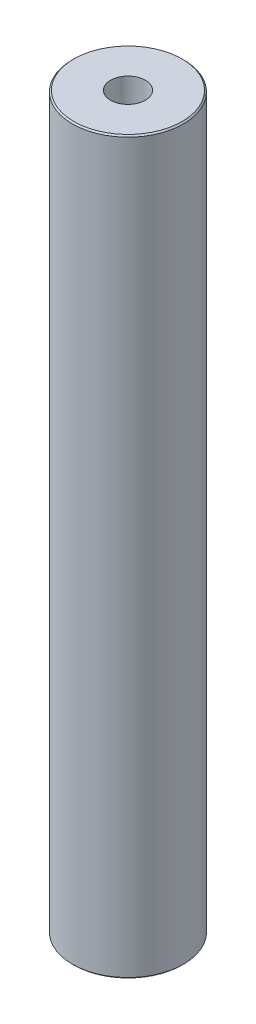
ISO-10303-21;
HEADER;
FILE_DESCRIPTION(('STEP AP214'),'2;1');
FILE_NAME('part.step','',(''),(''),'','','');
FILE_SCHEMA(('AUTOMOTIVE_DESIGN { 1 0 10303 214 1 1 1 1 }'));
ENDSEC;
DATA;
#1=APPLICATION_CONTEXT('core data for automotive mechanical design processes');
#2=APPLICATION_PROTOCOL_DEFINITION('international standard','automotive_design',2000,#1);
#3=PRODUCT_CONTEXT('',#1,'mechanical');
#4=PRODUCT('Part','Part','',(#3));
#5=PRODUCT_RELATED_PRODUCT_CATEGORY('part','',(#4));
#6=PRODUCT_DEFINITION_FORMATION('','',#4);
#7=PRODUCT_DEFINITION_CONTEXT('part definition',#1,'design');
#8=PRODUCT_DEFINITION('design','',#6,#7);
#9=PRODUCT_DEFINITION_SHAPE('','',#8);
#10=(LENGTH_UNIT() NAMED_UNIT(*) SI_UNIT(.MILLI.,.METRE.));
#11=(NAMED_UNIT(*) PLANE_ANGLE_UNIT() SI_UNIT($,.RADIAN.));
#12=(NAMED_UNIT(*) SI_UNIT($,.STERADIAN.) SOLID_ANGLE_UNIT());
#13=UNCERTAINTY_MEASURE_WITH_UNIT(LENGTH_MEASURE(1.E-05),#10,'distance_accuracy_value','');
#14=(GEOMETRIC_REPRESENTATION_CONTEXT(3) GLOBAL_UNCERTAINTY_ASSIGNED_CONTEXT((#13)) GLOBAL_UNIT_ASSIGNED_CONTEXT((#10,
#11,#12)) REPRESENTATION_CONTEXT('',''));
#15=CARTESIAN_POINT('',(0.,0.,0.));
#16=DIRECTION('',(0.,0.,1.));
#17=DIRECTION('',(1.,0.,0.));
#18=AXIS2_PLACEMENT_3D('',#15,#16,#17);
#19=CARTESIAN_POINT('',(0.,164.352950885282,0.));
#20=DIRECTION('',(0.,-1.,0.));
#21=DIRECTION('',(0.,0.,-1.));
#22=AXIS2_PLACEMENT_3D('',#19,#20,#21);
#23=CYLINDRICAL_SURFACE('',#22,12.5);
#24=CARTESIAN_POINT('',(0.,164.040160888838,0.));
#25=DIRECTION('',(0.,1.,0.));
#26=DIRECTION('',(0.,0.,1.));
#27=AXIS2_PLACEMENT_3D('',#24,#25,#26);
#28=CIRCLE('',#27,12.5);
#29=CARTESIAN_POINT('',(0.,164.040160888838,12.5));
#30=VERTEX_POINT('',#29);
#31=EDGE_CURVE('E50',#30,#30,#28,.F.);
#32=ORIENTED_EDGE('',*,*,#31,.T.);
#33=EDGE_LOOP('',(#32));
#34=FACE_BOUND('',#33,.T.);
#35=CARTESIAN_POINT('',(0.,0.312789996443491,0.));
#36=DIRECTION('',(0.,1.,0.));
#37=DIRECTION('',(0.,0.,1.));
#38=AXIS2_PLACEMENT_3D('',#35,#36,#37);
#39=CIRCLE('',#38,12.5);
#40=CARTESIAN_POINT('',(0.,0.312789996443491,12.5));
#41=VERTEX_POINT('',#40);
#42=EDGE_CURVE('E51',#41,#41,#39,.T.);
#43=ORIENTED_EDGE('',*,*,#42,.T.);
#44=EDGE_LOOP('',(#43));
#45=FACE_BOUND('',#44,.T.);
#46=ADVANCED_FACE('F39',(#34,#45),#23,.T.);
#47=CARTESIAN_POINT('',(0.,164.352950885282,0.));
#48=DIRECTION('',(0.,1.,0.));
#49=DIRECTION('',(0.,0.,1.));
#50=AXIS2_PLACEMENT_3D('',#47,#48,#49);
#51=PLANE('',#50);
#52=CARTESIAN_POINT('',(0.,164.352950885282,0.));
#53=DIRECTION('',(0.,1.,0.));
#54=DIRECTION('',(0.,0.,1.));
#55=AXIS2_PLACEMENT_3D('',#52,#53,#54);
#56=CIRCLE('',#55,12.1872100035565);
#57=CARTESIAN_POINT('',(0.,164.352950885282,12.1872100035565));
#58=VERTEX_POINT('',#57);
#59=EDGE_CURVE('E54',#58,#58,#56,.T.);
#60=ORIENTED_EDGE('',*,*,#59,.T.);
#61=EDGE_LOOP('',(#60));
#62=FACE_BOUND('',#61,.T.);
#63=CARTESIAN_POINT('',(0.,164.352950885282,0.));
#64=DIRECTION('',(0.,1.,0.));
#65=DIRECTION('',(0.,0.,1.));
#66=AXIS2_PLACEMENT_3D('',#63,#64,#65);
#67=CIRCLE('',#66,3.91145849696093);
#68=CARTESIAN_POINT('',(0.,164.352950885282,3.91145849696093));
#69=VERTEX_POINT('',#68);
#70=EDGE_CURVE('E58',#69,#69,#67,.T.);
#71=ORIENTED_EDGE('',*,*,#70,.F.);
#72=EDGE_LOOP('',(#71));
#73=FACE_BOUND('',#72,.T.);
#74=ADVANCED_FACE('F69',(#62,#73),#51,.T.);
#75=CARTESIAN_POINT('',(0.,0.,0.));
#76=DIRECTION('',(0.,1.,0.));
#77=DIRECTION('',(0.,0.,1.));
#78=AXIS2_PLACEMENT_3D('',#75,#76,#77);
#79=PLANE('',#78);
#80=CARTESIAN_POINT('',(0.,0.,0.));
#81=DIRECTION('',(0.,1.,0.));
#82=DIRECTION('',(0.,0.,1.));
#83=AXIS2_PLACEMENT_3D('',#80,#81,#82);
#84=CIRCLE('',#83,12.1872100035565);
#85=CARTESIAN_POINT('',(0.,0.,12.1872100035565));
#86=VERTEX_POINT('',#85);
#87=EDGE_CURVE('E10',#86,#86,#84,.F.);
#88=ORIENTED_EDGE('',*,*,#87,.T.);
#89=EDGE_LOOP('',(#88));
#90=FACE_BOUND('',#89,.T.);
#91=CARTESIAN_POINT('',(0.,0.,0.));
#92=DIRECTION('',(0.,1.,0.));
#93=DIRECTION('',(0.,0.,1.));
#94=AXIS2_PLACEMENT_3D('',#91,#92,#93);
#95=CIRCLE('',#94,3.91145849696093);
#96=CARTESIAN_POINT('',(0.,0.,3.91145849696093));
#97=VERTEX_POINT('',#96);
#98=EDGE_CURVE('E63',#97,#97,#95,.T.);
#99=ORIENTED_EDGE('',*,*,#98,.T.);
#100=EDGE_LOOP('',(#99));
#101=FACE_BOUND('',#100,.T.);
#102=ADVANCED_FACE('F75',(#90,#101),#79,.F.);
#103=CARTESIAN_POINT('',(0.,164.352950885282,0.));
#104=DIRECTION('',(0.,-1.,0.));
#105=DIRECTION('',(0.,0.,-1.));
#106=AXIS2_PLACEMENT_3D('',#103,#104,#105);
#107=CYLINDRICAL_SURFACE('',#106,3.91145849696093);
#108=ORIENTED_EDGE('',*,*,#70,.T.);
#109=EDGE_LOOP('',(#108));
#110=FACE_BOUND('',#109,.T.);
#111=ORIENTED_EDGE('',*,*,#98,.F.);
#112=EDGE_LOOP('',(#111));
#113=FACE_BOUND('',#112,.T.);
#114=ADVANCED_FACE('F70',(#110,#113),#107,.F.);
#115=CARTESIAN_POINT('',(0.,164.352950885282,0.));
#116=DIRECTION('',(0.,-1.,0.));
#117=DIRECTION('',(0.,0.,-1.));
#118=AXIS2_PLACEMENT_3D('',#115,#116,#117);
#119=CONICAL_SURFACE('',#118,12.1872100035565,0.785398163397365);
#120=ORIENTED_EDGE('',*,*,#31,.F.);
#121=EDGE_LOOP('',(#120));
#122=FACE_BOUND('',#121,.T.);
#123=ORIENTED_EDGE('',*,*,#59,.F.);
#124=EDGE_LOOP('',(#123));
#125=FACE_BOUND('',#124,.T.);
#126=ADVANCED_FACE('F81',(#122,#125),#119,.T.);
#127=CARTESIAN_POINT('',(0.,0.312789996443491,0.));
#128=DIRECTION('',(0.,1.,0.));
#129=DIRECTION('',(0.,0.,1.));
#130=AXIS2_PLACEMENT_3D('',#127,#128,#129);
#131=CONICAL_SURFACE('',#130,12.5,0.785398163397429);
#132=ORIENTED_EDGE('',*,*,#87,.F.);
#133=EDGE_LOOP('',(#132));
#134=FACE_BOUND('',#133,.T.);
#135=ORIENTED_EDGE('',*,*,#42,.F.);
#136=EDGE_LOOP('',(#135));
#137=FACE_BOUND('',#136,.T.);
#138=ADVANCED_FACE('F45',(#134,#137),#131,.T.);
#139=CLOSED_SHELL('',(#46,#74,#102,#114,#126,#138));
#140=MANIFOLD_SOLID_BREP('B2',#139);
#141=ADVANCED_BREP_SHAPE_REPRESENTATION('',(#18,#140),#14);
#142=SHAPE_DEFINITION_REPRESENTATION(#9,#141);
ENDSEC;
END-ISO-10303-21;
